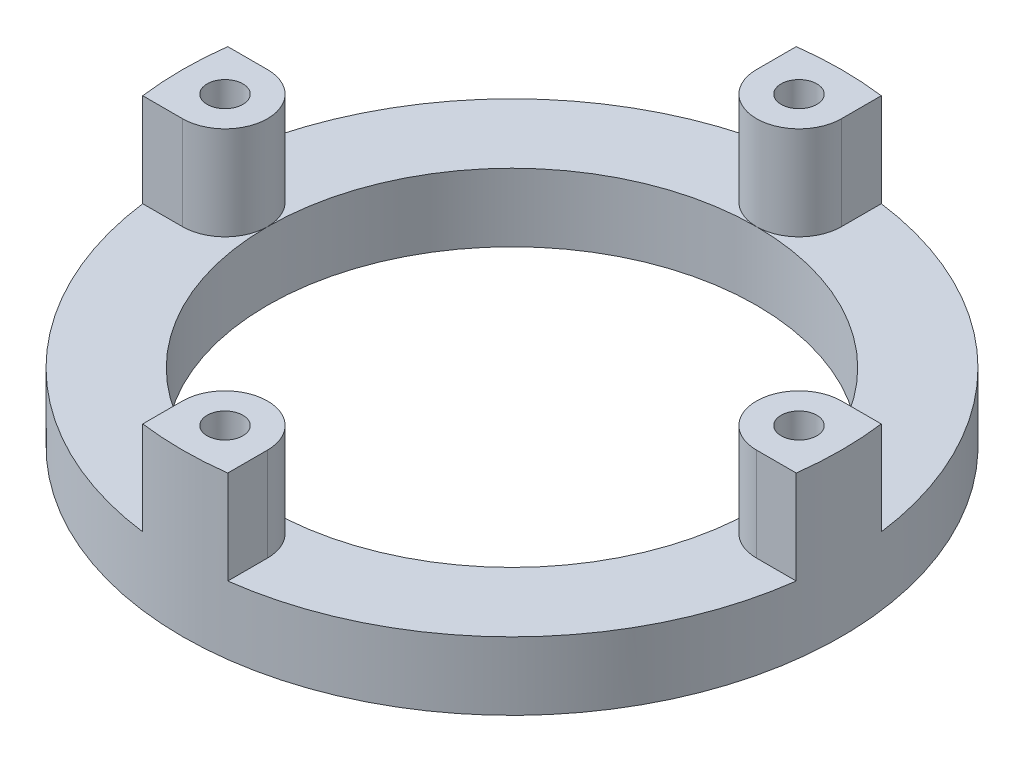
ISO-10303-21;
HEADER;
FILE_DESCRIPTION(('STEP AP214'),'2;1');
FILE_NAME('part.step','',(''),(''),'','','');
FILE_SCHEMA(('AUTOMOTIVE_DESIGN { 1 0 10303 214 1 1 1 1 }'));
ENDSEC;
DATA;
#1=APPLICATION_CONTEXT('core data for automotive mechanical design processes');
#2=APPLICATION_PROTOCOL_DEFINITION('international standard','automotive_design',2000,#1);
#3=PRODUCT_CONTEXT('',#1,'mechanical');
#4=PRODUCT('Part','Part','',(#3));
#5=PRODUCT_RELATED_PRODUCT_CATEGORY('part','',(#4));
#6=PRODUCT_DEFINITION_FORMATION('','',#4);
#7=PRODUCT_DEFINITION_CONTEXT('part definition',#1,'design');
#8=PRODUCT_DEFINITION('design','',#6,#7);
#9=PRODUCT_DEFINITION_SHAPE('','',#8);
#10=(LENGTH_UNIT() NAMED_UNIT(*) SI_UNIT(.MILLI.,.METRE.));
#11=(NAMED_UNIT(*) PLANE_ANGLE_UNIT() SI_UNIT($,.RADIAN.));
#12=(NAMED_UNIT(*) SI_UNIT($,.STERADIAN.) SOLID_ANGLE_UNIT());
#13=UNCERTAINTY_MEASURE_WITH_UNIT(LENGTH_MEASURE(1.E-05),#10,'distance_accuracy_value','');
#14=(GEOMETRIC_REPRESENTATION_CONTEXT(3) GLOBAL_UNCERTAINTY_ASSIGNED_CONTEXT((#13)) GLOBAL_UNIT_ASSIGNED_CONTEXT((#10,
#11,#12)) REPRESENTATION_CONTEXT('',''));
#15=CARTESIAN_POINT('',(0.,0.,0.));
#16=DIRECTION('',(0.,0.,1.));
#17=DIRECTION('',(1.,0.,0.));
#18=AXIS2_PLACEMENT_3D('',#15,#16,#17);
#19=CARTESIAN_POINT('',(0.,20.32,0.));
#20=DIRECTION('',(0.,1.,0.));
#21=DIRECTION('',(0.,0.,1.));
#22=AXIS2_PLACEMENT_3D('',#19,#20,#21);
#23=PLANE('',#22);
#24=CARTESIAN_POINT('',(0.,20.32,0.));
#25=DIRECTION('',(0.,1.,0.));
#26=DIRECTION('',(0.,0.,1.));
#27=AXIS2_PLACEMENT_3D('',#24,#25,#26);
#28=CIRCLE('',#27,98.425);
#29=CARTESIAN_POINT('',(12.7,20.32,97.6022060457652));
#30=VERTEX_POINT('',#29);
#31=CARTESIAN_POINT('',(97.6022060457653,20.32,12.699999999999));
#32=VERTEX_POINT('',#31);
#33=EDGE_CURVE('E441',#30,#32,#28,.T.);
#34=ORIENTED_EDGE('',*,*,#33,.T.);
#35=DIRECTION('',(1.,0.,0.));
#36=VECTOR('',#35,1.);
#37=CARTESIAN_POINT('',(85.7250000000001,20.32,12.6999999999991));
#38=LINE('',#37,#36);
#39=CARTESIAN_POINT('',(85.725,20.32,12.6999999999991));
#40=VERTEX_POINT('',#39);
#41=EDGE_CURVE('E53',#40,#32,#38,.T.);
#42=ORIENTED_EDGE('',*,*,#41,.F.);
#43=CARTESIAN_POINT('',(85.725,20.32,-8.97921713316983E-13));
#44=DIRECTION('',(0.,1.,0.));
#45=DIRECTION('',(-1.,0.,0.));
#46=AXIS2_PLACEMENT_3D('',#43,#44,#45);
#47=CIRCLE('',#46,12.7);
#48=CARTESIAN_POINT('',(73.025,20.32,-7.64896274307059E-13));
#49=VERTEX_POINT('',#48);
#50=EDGE_CURVE('E188',#49,#40,#47,.T.);
#51=ORIENTED_EDGE('',*,*,#50,.F.);
#52=CARTESIAN_POINT('',(0.,20.32,0.));
#53=DIRECTION('',(0.,1.,0.));
#54=DIRECTION('',(0.,0.,1.));
#55=AXIS2_PLACEMENT_3D('',#52,#53,#54);
#56=CIRCLE('',#55,73.025);
#57=CARTESIAN_POINT('',(0.,20.32,73.025));
#58=VERTEX_POINT('',#57);
#59=EDGE_CURVE('E454',#58,#49,#56,.T.);
#60=ORIENTED_EDGE('',*,*,#59,.F.);
#61=CARTESIAN_POINT('',(0.,20.32,85.725));
#62=DIRECTION('',(0.,1.,0.));
#63=DIRECTION('',(0.,0.,-1.));
#64=AXIS2_PLACEMENT_3D('',#61,#62,#63);
#65=CIRCLE('',#64,12.7);
#66=CARTESIAN_POINT('',(12.7,20.32,85.725));
#67=VERTEX_POINT('',#66);
#68=EDGE_CURVE('E209',#67,#58,#65,.T.);
#69=ORIENTED_EDGE('',*,*,#68,.F.);
#70=DIRECTION('',(0.,0.,-1.));
#71=VECTOR('',#70,1.);
#72=CARTESIAN_POINT('',(12.7,20.32,85.725));
#73=LINE('',#72,#71);
#74=EDGE_CURVE('E202',#30,#67,#73,.T.);
#75=ORIENTED_EDGE('',*,*,#74,.F.);
#76=EDGE_LOOP('',(#34,#42,#51,#60,#69,#75));
#77=FACE_BOUND('',#76,.T.);
#78=ADVANCED_FACE('F38',(#77),#23,.T.);
#79=CARTESIAN_POINT('',(-97.6022060457651,20.32,12.7000000000003));
#80=VERTEX_POINT('',#79);
#81=CARTESIAN_POINT('',(-12.7,20.32,97.6022060457652));
#82=VERTEX_POINT('',#81);
#83=EDGE_CURVE('E310',#80,#82,#28,.T.);
#84=ORIENTED_EDGE('',*,*,#83,.T.);
#85=DIRECTION('',(0.,0.,1.));
#86=VECTOR('',#85,1.);
#87=CARTESIAN_POINT('',(-12.7,20.32,85.725));
#88=LINE('',#87,#86);
#89=CARTESIAN_POINT('',(-12.7,20.32,85.725));
#90=VERTEX_POINT('',#89);
#91=EDGE_CURVE('E212',#90,#82,#88,.T.);
#92=ORIENTED_EDGE('',*,*,#91,.F.);
#93=EDGE_CURVE('E192',#58,#90,#65,.T.);
#94=ORIENTED_EDGE('',*,*,#93,.F.);
#95=CARTESIAN_POINT('',(-73.025,20.32,2.5496542476902E-13));
#96=VERTEX_POINT('',#95);
#97=EDGE_CURVE('E304',#96,#58,#56,.T.);
#98=ORIENTED_EDGE('',*,*,#97,.F.);
#99=CARTESIAN_POINT('',(-85.725,20.32,2.99307237772328E-13));
#100=DIRECTION('',(0.,1.,0.));
#101=DIRECTION('',(1.,0.,0.));
#102=AXIS2_PLACEMENT_3D('',#99,#100,#101);
#103=CIRCLE('',#102,12.7);
#104=CARTESIAN_POINT('',(-85.725,20.32,12.7000000000003));
#105=VERTEX_POINT('',#104);
#106=EDGE_CURVE('E243',#105,#96,#103,.T.);
#107=ORIENTED_EDGE('',*,*,#106,.F.);
#108=DIRECTION('',(1.,0.,0.));
#109=VECTOR('',#108,1.);
#110=CARTESIAN_POINT('',(-85.725,20.32,12.7000000000003));
#111=LINE('',#110,#109);
#112=EDGE_CURVE('E236',#80,#105,#111,.T.);
#113=ORIENTED_EDGE('',*,*,#112,.F.);
#114=EDGE_LOOP('',(#84,#92,#94,#98,#107,#113));
#115=FACE_BOUND('',#114,.T.);
#116=ADVANCED_FACE('F325',(#115),#23,.T.);
#117=CARTESIAN_POINT('',(-12.7,20.32,-97.6022060457652));
#118=VERTEX_POINT('',#117);
#119=CARTESIAN_POINT('',(-97.6022060457652,20.32,-12.6999999999997));
#120=VERTEX_POINT('',#119);
#121=EDGE_CURVE('E308',#118,#120,#28,.T.);
#122=ORIENTED_EDGE('',*,*,#121,.T.);
#123=DIRECTION('',(-1.,0.,0.));
#124=VECTOR('',#123,1.);
#125=CARTESIAN_POINT('',(-85.725,20.32,-12.6999999999997));
#126=LINE('',#125,#124);
#127=CARTESIAN_POINT('',(-85.725,20.32,-12.6999999999997));
#128=VERTEX_POINT('',#127);
#129=EDGE_CURVE('E246',#128,#120,#126,.T.);
#130=ORIENTED_EDGE('',*,*,#129,.F.);
#131=EDGE_CURVE('E231',#96,#128,#103,.T.);
#132=ORIENTED_EDGE('',*,*,#131,.F.);
#133=CARTESIAN_POINT('',(0.,20.32,-73.025));
#134=VERTEX_POINT('',#133);
#135=EDGE_CURVE('E300',#134,#96,#56,.T.);
#136=ORIENTED_EDGE('',*,*,#135,.F.);
#137=CARTESIAN_POINT('',(0.,20.32,-85.725));
#138=DIRECTION('',(0.,1.,0.));
#139=DIRECTION('',(0.,0.,1.));
#140=AXIS2_PLACEMENT_3D('',#137,#138,#139);
#141=CIRCLE('',#140,12.7);
#142=CARTESIAN_POINT('',(-12.7,20.32,-85.725));
#143=VERTEX_POINT('',#142);
#144=EDGE_CURVE('E266',#143,#134,#141,.T.);
#145=ORIENTED_EDGE('',*,*,#144,.F.);
#146=DIRECTION('',(0.,0.,1.));
#147=VECTOR('',#146,1.);
#148=CARTESIAN_POINT('',(-12.7,20.32,-85.725));
#149=LINE('',#148,#147);
#150=EDGE_CURVE('E273',#118,#143,#149,.T.);
#151=ORIENTED_EDGE('',*,*,#150,.F.);
#152=EDGE_LOOP('',(#122,#130,#132,#136,#145,#151));
#153=FACE_BOUND('',#152,.T.);
#154=ADVANCED_FACE('F324',(#153),#23,.T.);
#155=EDGE_CURVE('E305',#49,#134,#56,.T.);
#156=ORIENTED_EDGE('',*,*,#155,.F.);
#157=CARTESIAN_POINT('',(85.7249999999999,20.32,-12.7000000000009));
#158=VERTEX_POINT('',#157);
#159=EDGE_CURVE('E61',#158,#49,#47,.T.);
#160=ORIENTED_EDGE('',*,*,#159,.F.);
#161=DIRECTION('',(-1.,0.,0.));
#162=VECTOR('',#161,1.);
#163=CARTESIAN_POINT('',(85.7249999999999,20.32,-12.7000000000009));
#164=LINE('',#163,#162);
#165=CARTESIAN_POINT('',(97.602206045765,20.32,-12.700000000001));
#166=VERTEX_POINT('',#165);
#167=EDGE_CURVE('E185',#166,#158,#164,.T.);
#168=ORIENTED_EDGE('',*,*,#167,.F.);
#169=CARTESIAN_POINT('',(12.7,20.32,-97.6022060457651));
#170=VERTEX_POINT('',#169);
#171=EDGE_CURVE('E311',#166,#170,#28,.T.);
#172=ORIENTED_EDGE('',*,*,#171,.T.);
#173=DIRECTION('',(0.,0.,-1.));
#174=VECTOR('',#173,1.);
#175=CARTESIAN_POINT('',(12.7,20.32,-85.725));
#176=LINE('',#175,#174);
#177=CARTESIAN_POINT('',(12.7,20.32,-85.725));
#178=VERTEX_POINT('',#177);
#179=EDGE_CURVE('E282',#178,#170,#176,.T.);
#180=ORIENTED_EDGE('',*,*,#179,.F.);
#181=EDGE_CURVE('E283',#134,#178,#141,.T.);
#182=ORIENTED_EDGE('',*,*,#181,.F.);
#183=EDGE_LOOP('',(#156,#160,#168,#172,#180,#182));
#184=FACE_BOUND('',#183,.T.);
#185=ADVANCED_FACE('F334',(#184),#23,.T.);
#186=CARTESIAN_POINT('',(0.,0.,0.));
#187=DIRECTION('',(0.,1.,0.));
#188=DIRECTION('',(0.,0.,1.));
#189=AXIS2_PLACEMENT_3D('',#186,#187,#188);
#190=PLANE('',#189);
#191=CARTESIAN_POINT('',(0.,0.,0.));
#192=DIRECTION('',(0.,1.,0.));
#193=DIRECTION('',(0.,0.,1.));
#194=AXIS2_PLACEMENT_3D('',#191,#192,#193);
#195=CIRCLE('',#194,98.425);
#196=CARTESIAN_POINT('',(0.,0.,98.425));
#197=VERTEX_POINT('',#196);
#198=EDGE_CURVE('E303',#197,#197,#195,.T.);
#199=ORIENTED_EDGE('',*,*,#198,.F.);
#200=EDGE_LOOP('',(#199));
#201=FACE_BOUND('',#200,.T.);
#202=CARTESIAN_POINT('',(0.,0.,0.));
#203=DIRECTION('',(0.,1.,0.));
#204=DIRECTION('',(0.,0.,1.));
#205=AXIS2_PLACEMENT_3D('',#202,#203,#204);
#206=CIRCLE('',#205,73.025);
#207=CARTESIAN_POINT('',(0.,0.,73.025));
#208=VERTEX_POINT('',#207);
#209=EDGE_CURVE('E299',#208,#208,#206,.T.);
#210=ORIENTED_EDGE('',*,*,#209,.T.);
#211=EDGE_LOOP('',(#210));
#212=FACE_BOUND('',#211,.T.);
#213=ADVANCED_FACE('F349',(#201,#212),#190,.F.);
#214=CARTESIAN_POINT('',(0.,20.32,0.));
#215=DIRECTION('',(0.,-1.,0.));
#216=DIRECTION('',(0.,0.,-1.));
#217=AXIS2_PLACEMENT_3D('',#214,#215,#216);
#218=CYLINDRICAL_SURFACE('',#217,98.425);
#219=ORIENTED_EDGE('',*,*,#121,.F.);
#220=DIRECTION('',(0.,-1.,0.));
#221=VECTOR('',#220,1.);
#222=CARTESIAN_POINT('',(-12.7,48.26,-97.6022060457652));
#223=LINE('',#222,#221);
#224=CARTESIAN_POINT('',(-12.7,48.26,-97.6022060457652));
#225=VERTEX_POINT('',#224);
#226=EDGE_CURVE('E290',#225,#118,#223,.T.);
#227=ORIENTED_EDGE('',*,*,#226,.F.);
#228=CARTESIAN_POINT('',(0.,48.26,0.));
#229=DIRECTION('',(0.,1.,0.));
#230=DIRECTION('',(0.,0.,1.));
#231=AXIS2_PLACEMENT_3D('',#228,#229,#230);
#232=CIRCLE('',#231,98.425);
#233=CARTESIAN_POINT('',(12.7,48.26,-97.6022060457651));
#234=VERTEX_POINT('',#233);
#235=EDGE_CURVE('E275',#234,#225,#232,.T.);
#236=ORIENTED_EDGE('',*,*,#235,.F.);
#237=DIRECTION('',(0.,-1.,0.));
#238=VECTOR('',#237,1.);
#239=CARTESIAN_POINT('',(12.7,48.26,-97.6022060457651));
#240=LINE('',#239,#238);
#241=EDGE_CURVE('E293',#234,#170,#240,.T.);
#242=ORIENTED_EDGE('',*,*,#241,.T.);
#243=ORIENTED_EDGE('',*,*,#171,.F.);
#244=DIRECTION('',(0.,-1.,0.));
#245=VECTOR('',#244,1.);
#246=CARTESIAN_POINT('',(97.602206045765,48.26,-12.700000000001));
#247=LINE('',#246,#245);
#248=CARTESIAN_POINT('',(97.602206045765,48.26,-12.700000000001));
#249=VERTEX_POINT('',#248);
#250=EDGE_CURVE('E194',#249,#166,#247,.T.);
#251=ORIENTED_EDGE('',*,*,#250,.F.);
#252=CARTESIAN_POINT('',(0.,48.26,0.));
#253=DIRECTION('',(0.,1.,0.));
#254=DIRECTION('',(-1.,0.,0.));
#255=AXIS2_PLACEMENT_3D('',#252,#253,#254);
#256=CIRCLE('',#255,98.425);
#257=CARTESIAN_POINT('',(97.6022060457653,48.26,12.699999999999));
#258=VERTEX_POINT('',#257);
#259=EDGE_CURVE('E174',#258,#249,#256,.T.);
#260=ORIENTED_EDGE('',*,*,#259,.F.);
#261=DIRECTION('',(0.,-1.,0.));
#262=VECTOR('',#261,1.);
#263=CARTESIAN_POINT('',(97.6022060457653,48.26,12.699999999999));
#264=LINE('',#263,#262);
#265=EDGE_CURVE('E171',#258,#32,#264,.T.);
#266=ORIENTED_EDGE('',*,*,#265,.T.);
#267=ORIENTED_EDGE('',*,*,#33,.F.);
#268=DIRECTION('',(0.,-1.,0.));
#269=VECTOR('',#268,1.);
#270=CARTESIAN_POINT('',(12.7,48.26,97.6022060457652));
#271=LINE('',#270,#269);
#272=CARTESIAN_POINT('',(12.7,48.26,97.6022060457652));
#273=VERTEX_POINT('',#272);
#274=EDGE_CURVE('E219',#273,#30,#271,.T.);
#275=ORIENTED_EDGE('',*,*,#274,.F.);
#276=CARTESIAN_POINT('',(0.,48.26,0.));
#277=DIRECTION('',(0.,1.,0.));
#278=DIRECTION('',(0.,0.,-1.));
#279=AXIS2_PLACEMENT_3D('',#276,#277,#278);
#280=CIRCLE('',#279,98.425);
#281=CARTESIAN_POINT('',(-12.7,48.26,97.6022060457651));
#282=VERTEX_POINT('',#281);
#283=EDGE_CURVE('E204',#282,#273,#280,.T.);
#284=ORIENTED_EDGE('',*,*,#283,.F.);
#285=DIRECTION('',(0.,-1.,0.));
#286=VECTOR('',#285,1.);
#287=CARTESIAN_POINT('',(-12.7,48.26,97.6022060457651));
#288=LINE('',#287,#286);
#289=EDGE_CURVE('E222',#282,#82,#288,.T.);
#290=ORIENTED_EDGE('',*,*,#289,.T.);
#291=ORIENTED_EDGE('',*,*,#83,.F.);
#292=DIRECTION('',(0.,-1.,0.));
#293=VECTOR('',#292,1.);
#294=CARTESIAN_POINT('',(-97.6022060457651,48.26,12.7000000000003));
#295=LINE('',#294,#293);
#296=CARTESIAN_POINT('',(-97.6022060457651,48.26,12.7000000000003));
#297=VERTEX_POINT('',#296);
#298=EDGE_CURVE('E253',#297,#80,#295,.T.);
#299=ORIENTED_EDGE('',*,*,#298,.F.);
#300=CARTESIAN_POINT('',(0.,48.26,0.));
#301=DIRECTION('',(0.,1.,0.));
#302=DIRECTION('',(1.,0.,0.));
#303=AXIS2_PLACEMENT_3D('',#300,#301,#302);
#304=CIRCLE('',#303,98.425);
#305=CARTESIAN_POINT('',(-97.6022060457652,48.26,-12.6999999999997));
#306=VERTEX_POINT('',#305);
#307=EDGE_CURVE('E238',#306,#297,#304,.T.);
#308=ORIENTED_EDGE('',*,*,#307,.F.);
#309=DIRECTION('',(0.,-1.,0.));
#310=VECTOR('',#309,1.);
#311=CARTESIAN_POINT('',(-97.6022060457652,48.26,-12.6999999999997));
#312=LINE('',#311,#310);
#313=EDGE_CURVE('E256',#306,#120,#312,.T.);
#314=ORIENTED_EDGE('',*,*,#313,.T.);
#315=EDGE_LOOP('',(#219,#227,#236,#242,#243,#251,#260,#266,#267,#275,#284,#290,#291,#299,#308,#314));
#316=FACE_BOUND('',#315,.T.);
#317=ORIENTED_EDGE('',*,*,#198,.T.);
#318=EDGE_LOOP('',(#317));
#319=FACE_BOUND('',#318,.T.);
#320=ADVANCED_FACE('F40',(#316,#319),#218,.T.);
#321=CARTESIAN_POINT('',(0.,20.32,0.));
#322=DIRECTION('',(0.,-1.,0.));
#323=DIRECTION('',(0.,0.,-1.));
#324=AXIS2_PLACEMENT_3D('',#321,#322,#323);
#325=CYLINDRICAL_SURFACE('',#324,73.025);
#326=ORIENTED_EDGE('',*,*,#135,.T.);
#327=ORIENTED_EDGE('',*,*,#97,.T.);
#328=ORIENTED_EDGE('',*,*,#59,.T.);
#329=ORIENTED_EDGE('',*,*,#155,.T.);
#330=EDGE_LOOP('',(#326,#327,#328,#329));
#331=FACE_BOUND('',#330,.T.);
#332=ORIENTED_EDGE('',*,*,#209,.F.);
#333=EDGE_LOOP('',(#332));
#334=FACE_BOUND('',#333,.T.);
#335=ADVANCED_FACE('F404',(#331,#334),#325,.F.);
#336=CARTESIAN_POINT('',(0.,48.26,-85.725));
#337=DIRECTION('',(0.,1.,0.));
#338=DIRECTION('',(0.,0.,1.));
#339=AXIS2_PLACEMENT_3D('',#336,#337,#338);
#340=PLANE('',#339);
#341=CARTESIAN_POINT('',(0.,48.26,-85.725));
#342=DIRECTION('',(0.,1.,0.));
#343=DIRECTION('',(0.,0.,1.));
#344=AXIS2_PLACEMENT_3D('',#341,#342,#343);
#345=CIRCLE('',#344,12.7);
#346=CARTESIAN_POINT('',(-12.7,48.26,-85.725));
#347=VERTEX_POINT('',#346);
#348=CARTESIAN_POINT('',(12.7,48.26,-85.725));
#349=VERTEX_POINT('',#348);
#350=EDGE_CURVE('E269',#347,#349,#345,.T.);
#351=ORIENTED_EDGE('',*,*,#350,.T.);
#352=DIRECTION('',(0.,0.,-1.));
#353=VECTOR('',#352,1.);
#354=CARTESIAN_POINT('',(12.7,48.26,-85.725));
#355=LINE('',#354,#353);
#356=EDGE_CURVE('E272',#349,#234,#355,.T.);
#357=ORIENTED_EDGE('',*,*,#356,.T.);
#358=ORIENTED_EDGE('',*,*,#235,.T.);
#359=DIRECTION('',(0.,0.,1.));
#360=VECTOR('',#359,1.);
#361=CARTESIAN_POINT('',(-12.7,48.26,-85.725));
#362=LINE('',#361,#360);
#363=EDGE_CURVE('E277',#225,#347,#362,.T.);
#364=ORIENTED_EDGE('',*,*,#363,.T.);
#365=EDGE_LOOP('',(#351,#357,#358,#364));
#366=FACE_BOUND('',#365,.T.);
#367=CARTESIAN_POINT('',(0.,48.26,-85.725));
#368=DIRECTION('',(0.,1.,0.));
#369=DIRECTION('',(0.,0.,1.));
#370=AXIS2_PLACEMENT_3D('',#367,#368,#369);
#371=CIRCLE('',#370,5.334);
#372=CARTESIAN_POINT('',(0.,48.26,-80.391));
#373=VERTEX_POINT('',#372);
#374=EDGE_CURVE('E263',#373,#373,#371,.T.);
#375=ORIENTED_EDGE('',*,*,#374,.F.);
#376=EDGE_LOOP('',(#375));
#377=FACE_BOUND('',#376,.T.);
#378=ADVANCED_FACE('F400',(#366,#377),#340,.T.);
#379=CARTESIAN_POINT('',(0.,48.26,-85.725));
#380=DIRECTION('',(0.,-1.,0.));
#381=DIRECTION('',(0.,0.,-1.));
#382=AXIS2_PLACEMENT_3D('',#379,#380,#381);
#383=CYLINDRICAL_SURFACE('',#382,12.7);
#384=ORIENTED_EDGE('',*,*,#144,.T.);
#385=ORIENTED_EDGE('',*,*,#181,.T.);
#386=DIRECTION('',(0.,-1.,0.));
#387=VECTOR('',#386,1.);
#388=CARTESIAN_POINT('',(12.7,48.26,-85.725));
#389=LINE('',#388,#387);
#390=EDGE_CURVE('E296',#349,#178,#389,.T.);
#391=ORIENTED_EDGE('',*,*,#390,.F.);
#392=ORIENTED_EDGE('',*,*,#350,.F.);
#393=DIRECTION('',(0.,-1.,0.));
#394=VECTOR('',#393,1.);
#395=CARTESIAN_POINT('',(-12.7,48.26,-85.725));
#396=LINE('',#395,#394);
#397=EDGE_CURVE('E279',#347,#143,#396,.T.);
#398=ORIENTED_EDGE('',*,*,#397,.T.);
#399=EDGE_LOOP('',(#384,#385,#391,#392,#398));
#400=FACE_BOUND('',#399,.T.);
#401=ADVANCED_FACE('F403',(#400),#383,.T.);
#402=CARTESIAN_POINT('',(12.7,48.26,-85.725));
#403=DIRECTION('',(-1.,0.,0.));
#404=DIRECTION('',(0.,0.,1.));
#405=AXIS2_PLACEMENT_3D('',#402,#403,#404);
#406=PLANE('',#405);
#407=ORIENTED_EDGE('',*,*,#179,.T.);
#408=ORIENTED_EDGE('',*,*,#241,.F.);
#409=ORIENTED_EDGE('',*,*,#356,.F.);
#410=ORIENTED_EDGE('',*,*,#390,.T.);
#411=EDGE_LOOP('',(#407,#408,#409,#410));
#412=FACE_BOUND('',#411,.T.);
#413=ADVANCED_FACE('F408',(#412),#406,.F.);
#414=CARTESIAN_POINT('',(-12.7,48.26,-85.725));
#415=DIRECTION('',(1.,0.,0.));
#416=DIRECTION('',(0.,0.,-1.));
#417=AXIS2_PLACEMENT_3D('',#414,#415,#416);
#418=PLANE('',#417);
#419=ORIENTED_EDGE('',*,*,#150,.T.);
#420=ORIENTED_EDGE('',*,*,#397,.F.);
#421=ORIENTED_EDGE('',*,*,#363,.F.);
#422=ORIENTED_EDGE('',*,*,#226,.T.);
#423=EDGE_LOOP('',(#419,#420,#421,#422));
#424=FACE_BOUND('',#423,.T.);
#425=ADVANCED_FACE('F366',(#424),#418,.F.);
#426=CARTESIAN_POINT('',(0.,48.26,-85.725));
#427=DIRECTION('',(0.,-1.,0.));
#428=DIRECTION('',(0.,0.,-1.));
#429=AXIS2_PLACEMENT_3D('',#426,#427,#428);
#430=CYLINDRICAL_SURFACE('',#429,5.334);
#431=ORIENTED_EDGE('',*,*,#374,.T.);
#432=EDGE_LOOP('',(#431));
#433=FACE_BOUND('',#432,.T.);
#434=CARTESIAN_POINT('',(0.,20.32,-85.725));
#435=DIRECTION('',(0.,1.,0.));
#436=DIRECTION('',(0.,0.,1.));
#437=AXIS2_PLACEMENT_3D('',#434,#435,#436);
#438=CIRCLE('',#437,5.334);
#439=CARTESIAN_POINT('',(0.,20.32,-80.391));
#440=VERTEX_POINT('',#439);
#441=EDGE_CURVE('E262',#440,#440,#438,.T.);
#442=ORIENTED_EDGE('',*,*,#441,.F.);
#443=EDGE_LOOP('',(#442));
#444=FACE_BOUND('',#443,.T.);
#445=ADVANCED_FACE('F357',(#433,#444),#430,.F.);
#446=ORIENTED_EDGE('',*,*,#441,.T.);
#447=EDGE_LOOP('',(#446));
#448=FACE_BOUND('',#447,.T.);
#449=ADVANCED_FACE('F350',(#448),#23,.T.);
#450=CARTESIAN_POINT('',(-85.725,48.26,2.99307237772328E-13));
#451=DIRECTION('',(0.,1.,0.));
#452=DIRECTION('',(1.,0.,0.));
#453=AXIS2_PLACEMENT_3D('',#450,#451,#452);
#454=PLANE('',#453);
#455=CARTESIAN_POINT('',(-85.725,48.26,2.99307237772328E-13));
#456=DIRECTION('',(0.,1.,0.));
#457=DIRECTION('',(1.,0.,0.));
#458=AXIS2_PLACEMENT_3D('',#455,#456,#457);
#459=CIRCLE('',#458,12.7);
#460=CARTESIAN_POINT('',(-85.725,48.26,12.7000000000003));
#461=VERTEX_POINT('',#460);
#462=CARTESIAN_POINT('',(-85.725,48.26,-12.6999999999997));
#463=VERTEX_POINT('',#462);
#464=EDGE_CURVE('E232',#461,#463,#459,.T.);
#465=ORIENTED_EDGE('',*,*,#464,.T.);
#466=DIRECTION('',(-1.,0.,0.));
#467=VECTOR('',#466,1.);
#468=CARTESIAN_POINT('',(-85.725,48.26,-12.6999999999997));
#469=LINE('',#468,#467);
#470=EDGE_CURVE('E235',#463,#306,#469,.T.);
#471=ORIENTED_EDGE('',*,*,#470,.T.);
#472=ORIENTED_EDGE('',*,*,#307,.T.);
#473=DIRECTION('',(1.,0.,0.));
#474=VECTOR('',#473,1.);
#475=CARTESIAN_POINT('',(-85.725,48.26,12.7000000000003));
#476=LINE('',#475,#474);
#477=EDGE_CURVE('E240',#297,#461,#476,.T.);
#478=ORIENTED_EDGE('',*,*,#477,.T.);
#479=EDGE_LOOP('',(#465,#471,#472,#478));
#480=FACE_BOUND('',#479,.T.);
#481=CARTESIAN_POINT('',(-85.725,48.26,2.99307237772328E-13));
#482=DIRECTION('',(0.,1.,0.));
#483=DIRECTION('',(1.,0.,0.));
#484=AXIS2_PLACEMENT_3D('',#481,#482,#483);
#485=CIRCLE('',#484,5.334);
#486=CARTESIAN_POINT('',(-80.391,48.26,2.80683676310938E-13));
#487=VERTEX_POINT('',#486);
#488=EDGE_CURVE('E228',#487,#487,#485,.T.);
#489=ORIENTED_EDGE('',*,*,#488,.F.);
#490=EDGE_LOOP('',(#489));
#491=FACE_BOUND('',#490,.T.);
#492=ADVANCED_FACE('F356',(#480,#491),#454,.T.);
#493=CARTESIAN_POINT('',(-85.725,48.26,2.99307237772328E-13));
#494=DIRECTION('',(0.,-1.,0.));
#495=DIRECTION('',(0.,0.,-1.));
#496=AXIS2_PLACEMENT_3D('',#493,#494,#495);
#497=CYLINDRICAL_SURFACE('',#496,12.7);
#498=ORIENTED_EDGE('',*,*,#106,.T.);
#499=ORIENTED_EDGE('',*,*,#131,.T.);
#500=DIRECTION('',(0.,-1.,0.));
#501=VECTOR('',#500,1.);
#502=CARTESIAN_POINT('',(-85.725,48.26,-12.6999999999997));
#503=LINE('',#502,#501);
#504=EDGE_CURVE('E259',#463,#128,#503,.T.);
#505=ORIENTED_EDGE('',*,*,#504,.F.);
#506=ORIENTED_EDGE('',*,*,#464,.F.);
#507=DIRECTION('',(0.,-1.,0.));
#508=VECTOR('',#507,1.);
#509=CARTESIAN_POINT('',(-85.725,48.26,12.7000000000003));
#510=LINE('',#509,#508);
#511=EDGE_CURVE('E242',#461,#105,#510,.T.);
#512=ORIENTED_EDGE('',*,*,#511,.T.);
#513=EDGE_LOOP('',(#498,#499,#505,#506,#512));
#514=FACE_BOUND('',#513,.T.);
#515=ADVANCED_FACE('F363',(#514),#497,.T.);
#516=CARTESIAN_POINT('',(-85.725,48.26,-12.6999999999997));
#517=DIRECTION('',(0.,0.,1.));
#518=DIRECTION('',(1.,0.,0.));
#519=AXIS2_PLACEMENT_3D('',#516,#517,#518);
#520=PLANE('',#519);
#521=ORIENTED_EDGE('',*,*,#129,.T.);
#522=ORIENTED_EDGE('',*,*,#313,.F.);
#523=ORIENTED_EDGE('',*,*,#470,.F.);
#524=ORIENTED_EDGE('',*,*,#504,.T.);
#525=EDGE_LOOP('',(#521,#522,#523,#524));
#526=FACE_BOUND('',#525,.T.);
#527=ADVANCED_FACE('F388',(#526),#520,.F.);
#528=CARTESIAN_POINT('',(-85.725,48.26,12.7000000000003));
#529=DIRECTION('',(0.,0.,-1.));
#530=DIRECTION('',(-1.,0.,0.));
#531=AXIS2_PLACEMENT_3D('',#528,#529,#530);
#532=PLANE('',#531);
#533=ORIENTED_EDGE('',*,*,#112,.T.);
#534=ORIENTED_EDGE('',*,*,#511,.F.);
#535=ORIENTED_EDGE('',*,*,#477,.F.);
#536=ORIENTED_EDGE('',*,*,#298,.T.);
#537=EDGE_LOOP('',(#533,#534,#535,#536));
#538=FACE_BOUND('',#537,.T.);
#539=ADVANCED_FACE('F380',(#538),#532,.F.);
#540=CARTESIAN_POINT('',(-85.725,48.26,2.99307237772328E-13));
#541=DIRECTION('',(0.,-1.,0.));
#542=DIRECTION('',(0.,0.,-1.));
#543=AXIS2_PLACEMENT_3D('',#540,#541,#542);
#544=CYLINDRICAL_SURFACE('',#543,5.334);
#545=ORIENTED_EDGE('',*,*,#488,.T.);
#546=EDGE_LOOP('',(#545));
#547=FACE_BOUND('',#546,.T.);
#548=CARTESIAN_POINT('',(-85.725,20.32,2.99307237772328E-13));
#549=DIRECTION('',(0.,1.,0.));
#550=DIRECTION('',(0.,0.,1.));
#551=AXIS2_PLACEMENT_3D('',#548,#549,#550);
#552=CIRCLE('',#551,5.334);
#553=CARTESIAN_POINT('',(-85.725,20.32,5.3340000000003));
#554=VERTEX_POINT('',#553);
#555=EDGE_CURVE('E314',#554,#554,#552,.F.);
#556=ORIENTED_EDGE('',*,*,#555,.T.);
#557=EDGE_LOOP('',(#556));
#558=FACE_BOUND('',#557,.T.);
#559=ADVANCED_FACE('F371',(#547,#558),#544,.F.);
#560=ORIENTED_EDGE('',*,*,#555,.F.);
#561=EDGE_LOOP('',(#560));
#562=FACE_BOUND('',#561,.T.);
#563=ADVANCED_FACE('F338',(#562),#23,.T.);
#564=CARTESIAN_POINT('',(0.,48.26,85.725));
#565=DIRECTION('',(0.,1.,0.));
#566=DIRECTION('',(0.,0.,-1.));
#567=AXIS2_PLACEMENT_3D('',#564,#565,#566);
#568=PLANE('',#567);
#569=CARTESIAN_POINT('',(0.,48.26,85.725));
#570=DIRECTION('',(0.,1.,0.));
#571=DIRECTION('',(0.,0.,-1.));
#572=AXIS2_PLACEMENT_3D('',#569,#570,#571);
#573=CIRCLE('',#572,12.7);
#574=CARTESIAN_POINT('',(12.7,48.26,85.725));
#575=VERTEX_POINT('',#574);
#576=CARTESIAN_POINT('',(-12.7,48.26,85.725));
#577=VERTEX_POINT('',#576);
#578=EDGE_CURVE('E198',#575,#577,#573,.T.);
#579=ORIENTED_EDGE('',*,*,#578,.T.);
#580=DIRECTION('',(0.,0.,1.));
#581=VECTOR('',#580,1.);
#582=CARTESIAN_POINT('',(-12.7,48.26,85.725));
#583=LINE('',#582,#581);
#584=EDGE_CURVE('E201',#577,#282,#583,.T.);
#585=ORIENTED_EDGE('',*,*,#584,.T.);
#586=ORIENTED_EDGE('',*,*,#283,.T.);
#587=DIRECTION('',(0.,0.,-1.));
#588=VECTOR('',#587,1.);
#589=CARTESIAN_POINT('',(12.7,48.26,85.725));
#590=LINE('',#589,#588);
#591=EDGE_CURVE('E206',#273,#575,#590,.T.);
#592=ORIENTED_EDGE('',*,*,#591,.T.);
#593=EDGE_LOOP('',(#579,#585,#586,#592));
#594=FACE_BOUND('',#593,.T.);
#595=CARTESIAN_POINT('',(0.,48.26,85.725));
#596=DIRECTION('',(0.,1.,0.));
#597=DIRECTION('',(0.,0.,-1.));
#598=AXIS2_PLACEMENT_3D('',#595,#596,#597);
#599=CIRCLE('',#598,5.334);
#600=CARTESIAN_POINT('',(0.,48.26,80.391));
#601=VERTEX_POINT('',#600);
#602=EDGE_CURVE('E189',#601,#601,#599,.T.);
#603=ORIENTED_EDGE('',*,*,#602,.F.);
#604=EDGE_LOOP('',(#603));
#605=FACE_BOUND('',#604,.T.);
#606=ADVANCED_FACE('F370',(#594,#605),#568,.T.);
#607=CARTESIAN_POINT('',(0.,48.26,85.725));
#608=DIRECTION('',(0.,-1.,0.));
#609=DIRECTION('',(0.,0.,-1.));
#610=AXIS2_PLACEMENT_3D('',#607,#608,#609);
#611=CYLINDRICAL_SURFACE('',#610,12.7);
#612=ORIENTED_EDGE('',*,*,#68,.T.);
#613=ORIENTED_EDGE('',*,*,#93,.T.);
#614=DIRECTION('',(0.,-1.,0.));
#615=VECTOR('',#614,1.);
#616=CARTESIAN_POINT('',(-12.7,48.26,85.725));
#617=LINE('',#616,#615);
#618=EDGE_CURVE('E225',#577,#90,#617,.T.);
#619=ORIENTED_EDGE('',*,*,#618,.F.);
#620=ORIENTED_EDGE('',*,*,#578,.F.);
#621=DIRECTION('',(0.,-1.,0.));
#622=VECTOR('',#621,1.);
#623=CARTESIAN_POINT('',(12.7,48.26,85.725));
#624=LINE('',#623,#622);
#625=EDGE_CURVE('E208',#575,#67,#624,.T.);
#626=ORIENTED_EDGE('',*,*,#625,.T.);
#627=EDGE_LOOP('',(#612,#613,#619,#620,#626));
#628=FACE_BOUND('',#627,.T.);
#629=ADVANCED_FACE('F377',(#628),#611,.T.);
#630=CARTESIAN_POINT('',(-12.7,48.26,85.725));
#631=DIRECTION('',(1.,0.,0.));
#632=DIRECTION('',(0.,0.,-1.));
#633=AXIS2_PLACEMENT_3D('',#630,#631,#632);
#634=PLANE('',#633);
#635=ORIENTED_EDGE('',*,*,#91,.T.);
#636=ORIENTED_EDGE('',*,*,#289,.F.);
#637=ORIENTED_EDGE('',*,*,#584,.F.);
#638=ORIENTED_EDGE('',*,*,#618,.T.);
#639=EDGE_LOOP('',(#635,#636,#637,#638));
#640=FACE_BOUND('',#639,.T.);
#641=ADVANCED_FACE('F484',(#640),#634,.F.);
#642=CARTESIAN_POINT('',(12.7,48.26,85.725));
#643=DIRECTION('',(-1.,0.,0.));
#644=DIRECTION('',(0.,0.,1.));
#645=AXIS2_PLACEMENT_3D('',#642,#643,#644);
#646=PLANE('',#645);
#647=ORIENTED_EDGE('',*,*,#74,.T.);
#648=ORIENTED_EDGE('',*,*,#625,.F.);
#649=ORIENTED_EDGE('',*,*,#591,.F.);
#650=ORIENTED_EDGE('',*,*,#274,.T.);
#651=EDGE_LOOP('',(#647,#648,#649,#650));
#652=FACE_BOUND('',#651,.T.);
#653=ADVANCED_FACE('F331',(#652),#646,.F.);
#654=CARTESIAN_POINT('',(0.,48.26,85.725));
#655=DIRECTION('',(0.,-1.,0.));
#656=DIRECTION('',(0.,0.,-1.));
#657=AXIS2_PLACEMENT_3D('',#654,#655,#656);
#658=CYLINDRICAL_SURFACE('',#657,5.334);
#659=ORIENTED_EDGE('',*,*,#602,.T.);
#660=EDGE_LOOP('',(#659));
#661=FACE_BOUND('',#660,.T.);
#662=CARTESIAN_POINT('',(0.,20.32,85.725));
#663=DIRECTION('',(0.,1.,0.));
#664=DIRECTION('',(0.,0.,1.));
#665=AXIS2_PLACEMENT_3D('',#662,#663,#664);
#666=CIRCLE('',#665,5.334);
#667=CARTESIAN_POINT('',(0.,20.32,91.059));
#668=VERTEX_POINT('',#667);
#669=EDGE_CURVE('E46',#668,#668,#666,.F.);
#670=ORIENTED_EDGE('',*,*,#669,.T.);
#671=EDGE_LOOP('',(#670));
#672=FACE_BOUND('',#671,.T.);
#673=ADVANCED_FACE('F319',(#661,#672),#658,.F.);
#674=ORIENTED_EDGE('',*,*,#669,.F.);
#675=EDGE_LOOP('',(#674));
#676=FACE_BOUND('',#675,.T.);
#677=ADVANCED_FACE('F321',(#676),#23,.T.);
#678=CARTESIAN_POINT('',(85.725,48.26,-8.97921713316983E-13));
#679=DIRECTION('',(0.,1.,0.));
#680=DIRECTION('',(-1.,0.,0.));
#681=AXIS2_PLACEMENT_3D('',#678,#679,#680);
#682=PLANE('',#681);
#683=CARTESIAN_POINT('',(85.725,48.26,-8.97921713316983E-13));
#684=DIRECTION('',(0.,1.,0.));
#685=DIRECTION('',(-1.,0.,0.));
#686=AXIS2_PLACEMENT_3D('',#683,#684,#685);
#687=CIRCLE('',#686,12.7);
#688=CARTESIAN_POINT('',(85.7249999999999,48.26,-12.7000000000009));
#689=VERTEX_POINT('',#688);
#690=CARTESIAN_POINT('',(85.7250000000001,48.26,12.6999999999991));
#691=VERTEX_POINT('',#690);
#692=EDGE_CURVE('E175',#689,#691,#687,.T.);
#693=ORIENTED_EDGE('',*,*,#692,.T.);
#694=DIRECTION('',(1.,0.,0.));
#695=VECTOR('',#694,1.);
#696=CARTESIAN_POINT('',(85.7250000000001,48.26,12.6999999999991));
#697=LINE('',#696,#695);
#698=EDGE_CURVE('E165',#691,#258,#697,.T.);
#699=ORIENTED_EDGE('',*,*,#698,.T.);
#700=ORIENTED_EDGE('',*,*,#259,.T.);
#701=DIRECTION('',(-1.,0.,0.));
#702=VECTOR('',#701,1.);
#703=CARTESIAN_POINT('',(85.7249999999999,48.26,-12.7000000000009));
#704=LINE('',#703,#702);
#705=EDGE_CURVE('E181',#249,#689,#704,.T.);
#706=ORIENTED_EDGE('',*,*,#705,.T.);
#707=EDGE_LOOP('',(#693,#699,#700,#706));
#708=FACE_BOUND('',#707,.T.);
#709=CARTESIAN_POINT('',(85.725,48.26,-8.97921713316983E-13));
#710=DIRECTION('',(0.,1.,0.));
#711=DIRECTION('',(-1.,0.,0.));
#712=AXIS2_PLACEMENT_3D('',#709,#710,#711);
#713=CIRCLE('',#712,5.334);
#714=CARTESIAN_POINT('',(80.391,48.26,-8.42051028932815E-13));
#715=VERTEX_POINT('',#714);
#716=EDGE_CURVE('E459',#715,#715,#713,.T.);
#717=ORIENTED_EDGE('',*,*,#716,.F.);
#718=EDGE_LOOP('',(#717));
#719=FACE_BOUND('',#718,.T.);
#720=ADVANCED_FACE('F178',(#708,#719),#682,.T.);
#721=CARTESIAN_POINT('',(85.725,48.26,-8.97921713316983E-13));
#722=DIRECTION('',(0.,-1.,0.));
#723=DIRECTION('',(0.,0.,-1.));
#724=AXIS2_PLACEMENT_3D('',#721,#722,#723);
#725=CYLINDRICAL_SURFACE('',#724,12.7);
#726=ORIENTED_EDGE('',*,*,#159,.T.);
#727=ORIENTED_EDGE('',*,*,#50,.T.);
#728=DIRECTION('',(0.,-1.,0.));
#729=VECTOR('',#728,1.);
#730=CARTESIAN_POINT('',(85.7250000000001,48.26,12.6999999999991));
#731=LINE('',#730,#729);
#732=EDGE_CURVE('E169',#691,#40,#731,.T.);
#733=ORIENTED_EDGE('',*,*,#732,.F.);
#734=ORIENTED_EDGE('',*,*,#692,.F.);
#735=DIRECTION('',(0.,-1.,0.));
#736=VECTOR('',#735,1.);
#737=CARTESIAN_POINT('',(85.7249999999999,48.26,-12.7000000000009));
#738=LINE('',#737,#736);
#739=EDGE_CURVE('E456',#689,#158,#738,.T.);
#740=ORIENTED_EDGE('',*,*,#739,.T.);
#741=EDGE_LOOP('',(#726,#727,#733,#734,#740));
#742=FACE_BOUND('',#741,.T.);
#743=ADVANCED_FACE('F187',(#742),#725,.T.);
#744=CARTESIAN_POINT('',(85.7250000000001,48.26,12.6999999999991));
#745=DIRECTION('',(0.,0.,-1.));
#746=DIRECTION('',(-1.,0.,0.));
#747=AXIS2_PLACEMENT_3D('',#744,#745,#746);
#748=PLANE('',#747);
#749=ORIENTED_EDGE('',*,*,#41,.T.);
#750=ORIENTED_EDGE('',*,*,#265,.F.);
#751=ORIENTED_EDGE('',*,*,#698,.F.);
#752=ORIENTED_EDGE('',*,*,#732,.T.);
#753=EDGE_LOOP('',(#749,#750,#751,#752));
#754=FACE_BOUND('',#753,.T.);
#755=ADVANCED_FACE('F167',(#754),#748,.F.);
#756=CARTESIAN_POINT('',(85.7249999999999,48.26,-12.7000000000009));
#757=DIRECTION('',(0.,0.,1.));
#758=DIRECTION('',(1.,0.,0.));
#759=AXIS2_PLACEMENT_3D('',#756,#757,#758);
#760=PLANE('',#759);
#761=ORIENTED_EDGE('',*,*,#167,.T.);
#762=ORIENTED_EDGE('',*,*,#739,.F.);
#763=ORIENTED_EDGE('',*,*,#705,.F.);
#764=ORIENTED_EDGE('',*,*,#250,.T.);
#765=EDGE_LOOP('',(#761,#762,#763,#764));
#766=FACE_BOUND('',#765,.T.);
#767=ADVANCED_FACE('F465',(#766),#760,.F.);
#768=CARTESIAN_POINT('',(85.725,48.26,-8.97921713316983E-13));
#769=DIRECTION('',(0.,-1.,0.));
#770=DIRECTION('',(0.,0.,-1.));
#771=AXIS2_PLACEMENT_3D('',#768,#769,#770);
#772=CYLINDRICAL_SURFACE('',#771,5.334);
#773=ORIENTED_EDGE('',*,*,#716,.T.);
#774=EDGE_LOOP('',(#773));
#775=FACE_BOUND('',#774,.T.);
#776=CARTESIAN_POINT('',(85.725,20.32,-8.97921713316983E-13));
#777=DIRECTION('',(0.,1.,0.));
#778=DIRECTION('',(0.,0.,1.));
#779=AXIS2_PLACEMENT_3D('',#776,#777,#778);
#780=CIRCLE('',#779,5.334);
#781=CARTESIAN_POINT('',(85.725,20.32,5.3339999999991));
#782=VERTEX_POINT('',#781);
#783=EDGE_CURVE('E11',#782,#782,#780,.F.);
#784=ORIENTED_EDGE('',*,*,#783,.T.);
#785=EDGE_LOOP('',(#784));
#786=FACE_BOUND('',#785,.T.);
#787=ADVANCED_FACE('F346',(#775,#786),#772,.F.);
#788=ORIENTED_EDGE('',*,*,#783,.F.);
#789=EDGE_LOOP('',(#788));
#790=FACE_BOUND('',#789,.T.);
#791=ADVANCED_FACE('F341',(#790),#23,.T.);
#792=CLOSED_SHELL('',(#78,#116,#154,#185,#213,#320,#335,#378,#401,#413,#425,#445,#449,#492,#515,
#527,#539,#559,#563,#606,#629,#641,#653,#673,#677,#720,#743,#755,#767,#787,#791));
#793=MANIFOLD_SOLID_BREP('B2',#792);
#794=ADVANCED_BREP_SHAPE_REPRESENTATION('',(#18,#793),#14);
#795=SHAPE_DEFINITION_REPRESENTATION(#9,#794);
ENDSEC;
END-ISO-10303-21;
